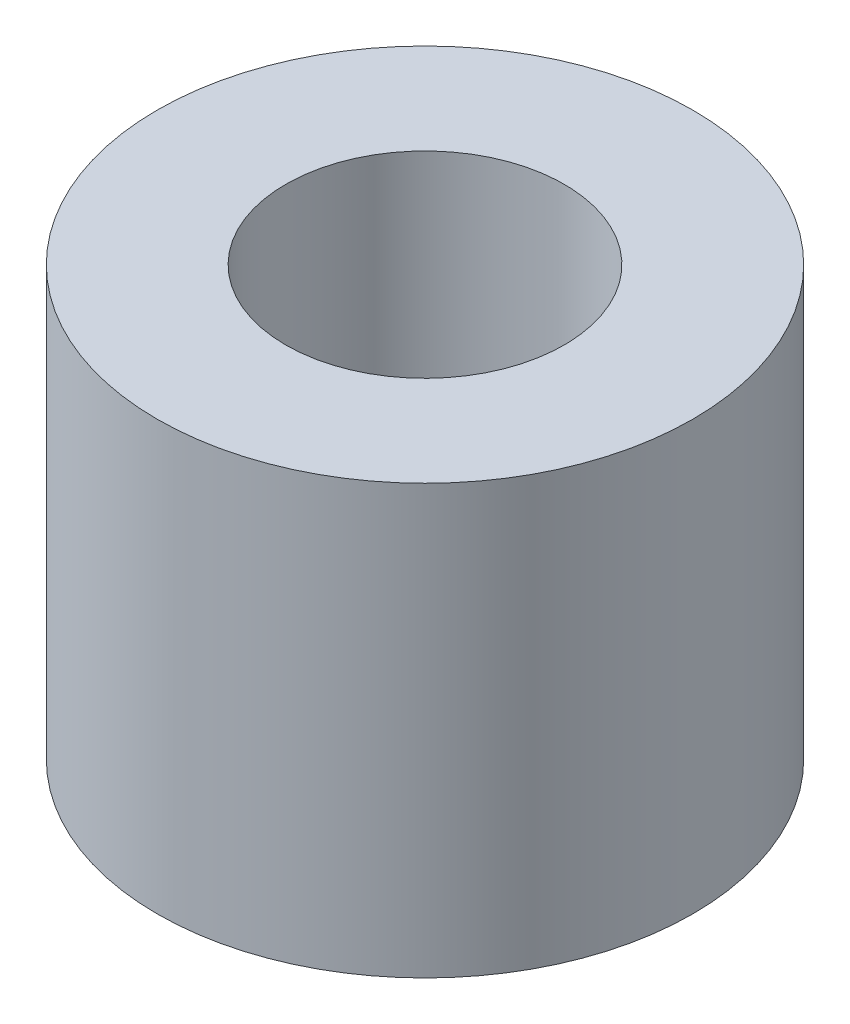
ISO-10303-21;
HEADER;
FILE_DESCRIPTION(('STEP AP214'),'2;1');
FILE_NAME('part.step','',(''),(''),'','','');
FILE_SCHEMA(('AUTOMOTIVE_DESIGN { 1 0 10303 214 1 1 1 1 }'));
ENDSEC;
DATA;
#1=APPLICATION_CONTEXT('core data for automotive mechanical design processes');
#2=APPLICATION_PROTOCOL_DEFINITION('international standard','automotive_design',2000,#1);
#3=PRODUCT_CONTEXT('',#1,'mechanical');
#4=PRODUCT('Part','Part','',(#3));
#5=PRODUCT_RELATED_PRODUCT_CATEGORY('part','',(#4));
#6=PRODUCT_DEFINITION_FORMATION('','',#4);
#7=PRODUCT_DEFINITION_CONTEXT('part definition',#1,'design');
#8=PRODUCT_DEFINITION('design','',#6,#7);
#9=PRODUCT_DEFINITION_SHAPE('','',#8);
#10=(LENGTH_UNIT() NAMED_UNIT(*) SI_UNIT(.MILLI.,.METRE.));
#11=(NAMED_UNIT(*) PLANE_ANGLE_UNIT() SI_UNIT($,.RADIAN.));
#12=(NAMED_UNIT(*) SI_UNIT($,.STERADIAN.) SOLID_ANGLE_UNIT());
#13=UNCERTAINTY_MEASURE_WITH_UNIT(LENGTH_MEASURE(1.E-05),#10,'distance_accuracy_value','');
#14=(GEOMETRIC_REPRESENTATION_CONTEXT(3) GLOBAL_UNCERTAINTY_ASSIGNED_CONTEXT((#13)) GLOBAL_UNIT_ASSIGNED_CONTEXT((#10,
#11,#12)) REPRESENTATION_CONTEXT('',''));
#15=CARTESIAN_POINT('',(0.,0.,0.));
#16=DIRECTION('',(0.,0.,1.));
#17=DIRECTION('',(1.,0.,0.));
#18=AXIS2_PLACEMENT_3D('',#15,#16,#17);
#19=CARTESIAN_POINT('',(0.,10.16,0.));
#20=DIRECTION('',(0.,1.,0.));
#21=DIRECTION('',(0.,0.,1.));
#22=AXIS2_PLACEMENT_3D('',#19,#20,#21);
#23=PLANE('',#22);
#24=CARTESIAN_POINT('',(0.,10.16,0.));
#25=DIRECTION('',(0.,1.,0.));
#26=DIRECTION('',(0.,0.,1.));
#27=AXIS2_PLACEMENT_3D('',#24,#25,#26);
#28=CIRCLE('',#27,6.35);
#29=CARTESIAN_POINT('',(0.,10.16,6.35));
#30=VERTEX_POINT('',#29);
#31=EDGE_CURVE('E10',#30,#30,#28,.T.);
#32=ORIENTED_EDGE('',*,*,#31,.T.);
#33=EDGE_LOOP('',(#32));
#34=FACE_BOUND('',#33,.T.);
#35=CARTESIAN_POINT('',(0.,10.16,0.));
#36=DIRECTION('',(0.,1.,0.));
#37=DIRECTION('',(0.,0.,1.));
#38=AXIS2_PLACEMENT_3D('',#35,#36,#37);
#39=CIRCLE('',#38,3.302);
#40=CARTESIAN_POINT('',(0.,10.16,3.302));
#41=VERTEX_POINT('',#40);
#42=EDGE_CURVE('E41',#41,#41,#39,.T.);
#43=ORIENTED_EDGE('',*,*,#42,.F.);
#44=EDGE_LOOP('',(#43));
#45=FACE_BOUND('',#44,.T.);
#46=ADVANCED_FACE('F30',(#34,#45),#23,.T.);
#47=CARTESIAN_POINT('',(0.,0.,0.));
#48=DIRECTION('',(0.,1.,0.));
#49=DIRECTION('',(0.,0.,1.));
#50=AXIS2_PLACEMENT_3D('',#47,#48,#49);
#51=PLANE('',#50);
#52=CARTESIAN_POINT('',(0.,0.,0.));
#53=DIRECTION('',(0.,1.,0.));
#54=DIRECTION('',(0.,0.,1.));
#55=AXIS2_PLACEMENT_3D('',#52,#53,#54);
#56=CIRCLE('',#55,6.35);
#57=CARTESIAN_POINT('',(0.,0.,6.35));
#58=VERTEX_POINT('',#57);
#59=EDGE_CURVE('E34',#58,#58,#56,.T.);
#60=ORIENTED_EDGE('',*,*,#59,.F.);
#61=EDGE_LOOP('',(#60));
#62=FACE_BOUND('',#61,.T.);
#63=CARTESIAN_POINT('',(0.,0.,0.));
#64=DIRECTION('',(0.,1.,0.));
#65=DIRECTION('',(0.,0.,1.));
#66=AXIS2_PLACEMENT_3D('',#63,#64,#65);
#67=CIRCLE('',#66,3.302);
#68=CARTESIAN_POINT('',(0.,0.,3.302));
#69=VERTEX_POINT('',#68);
#70=EDGE_CURVE('E43',#69,#69,#67,.T.);
#71=ORIENTED_EDGE('',*,*,#70,.T.);
#72=EDGE_LOOP('',(#71));
#73=FACE_BOUND('',#72,.T.);
#74=ADVANCED_FACE('F53',(#62,#73),#51,.F.);
#75=CARTESIAN_POINT('',(0.,10.16,0.));
#76=DIRECTION('',(0.,-1.,0.));
#77=DIRECTION('',(0.,0.,-1.));
#78=AXIS2_PLACEMENT_3D('',#75,#76,#77);
#79=CYLINDRICAL_SURFACE('',#78,6.35);
#80=ORIENTED_EDGE('',*,*,#31,.F.);
#81=EDGE_LOOP('',(#80));
#82=FACE_BOUND('',#81,.T.);
#83=ORIENTED_EDGE('',*,*,#59,.T.);
#84=EDGE_LOOP('',(#83));
#85=FACE_BOUND('',#84,.T.);
#86=ADVANCED_FACE('F32',(#82,#85),#79,.T.);
#87=CARTESIAN_POINT('',(0.,10.16,0.));
#88=DIRECTION('',(0.,-1.,0.));
#89=DIRECTION('',(0.,0.,-1.));
#90=AXIS2_PLACEMENT_3D('',#87,#88,#89);
#91=CYLINDRICAL_SURFACE('',#90,3.302);
#92=ORIENTED_EDGE('',*,*,#42,.T.);
#93=EDGE_LOOP('',(#92));
#94=FACE_BOUND('',#93,.T.);
#95=ORIENTED_EDGE('',*,*,#70,.F.);
#96=EDGE_LOOP('',(#95));
#97=FACE_BOUND('',#96,.T.);
#98=ADVANCED_FACE('F49',(#94,#97),#91,.F.);
#99=CLOSED_SHELL('',(#46,#74,#86,#98));
#100=MANIFOLD_SOLID_BREP('B2',#99);
#101=ADVANCED_BREP_SHAPE_REPRESENTATION('',(#18,#100),#14);
#102=SHAPE_DEFINITION_REPRESENTATION(#9,#101);
ENDSEC;
END-ISO-10303-21;
